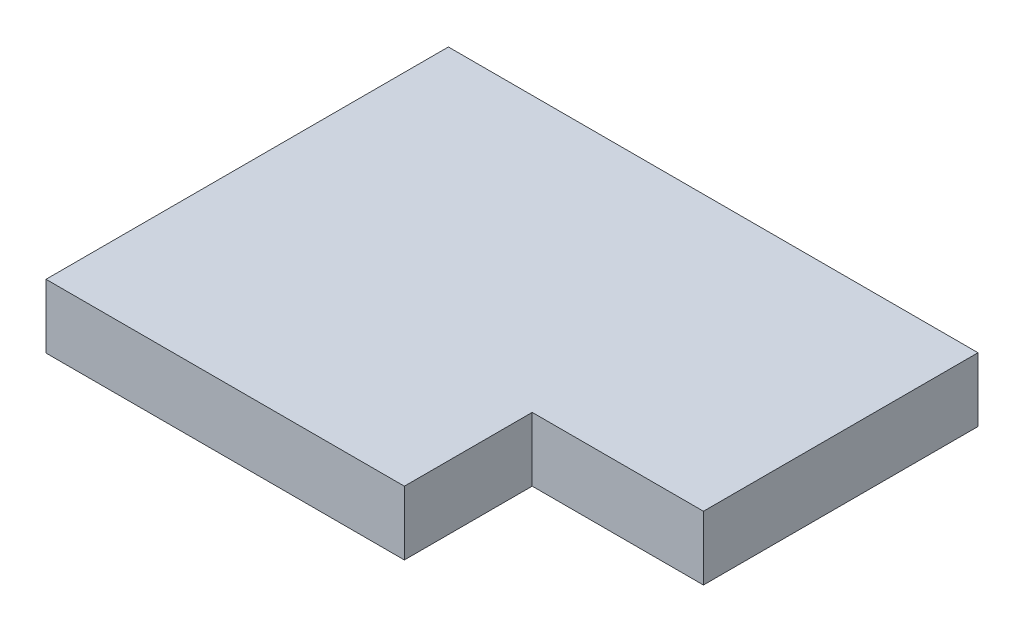
ISO-10303-21;
HEADER;
FILE_DESCRIPTION(('STEP AP214'),'2;1');
FILE_NAME('part.step','',(''),(''),'','','');
FILE_SCHEMA(('AUTOMOTIVE_DESIGN { 1 0 10303 214 1 1 1 1 }'));
ENDSEC;
DATA;
#1=APPLICATION_CONTEXT('core data for automotive mechanical design processes');
#2=APPLICATION_PROTOCOL_DEFINITION('international standard','automotive_design',2000,#1);
#3=PRODUCT_CONTEXT('',#1,'mechanical');
#4=PRODUCT('Part','Part','',(#3));
#5=PRODUCT_RELATED_PRODUCT_CATEGORY('part','',(#4));
#6=PRODUCT_DEFINITION_FORMATION('','',#4);
#7=PRODUCT_DEFINITION_CONTEXT('part definition',#1,'design');
#8=PRODUCT_DEFINITION('design','',#6,#7);
#9=PRODUCT_DEFINITION_SHAPE('','',#8);
#10=(LENGTH_UNIT() NAMED_UNIT(*) SI_UNIT(.MILLI.,.METRE.));
#11=(NAMED_UNIT(*) PLANE_ANGLE_UNIT() SI_UNIT($,.RADIAN.));
#12=(NAMED_UNIT(*) SI_UNIT($,.STERADIAN.) SOLID_ANGLE_UNIT());
#13=UNCERTAINTY_MEASURE_WITH_UNIT(LENGTH_MEASURE(1.E-05),#10,'distance_accuracy_value','');
#14=(GEOMETRIC_REPRESENTATION_CONTEXT(3) GLOBAL_UNCERTAINTY_ASSIGNED_CONTEXT((#13)) GLOBAL_UNIT_ASSIGNED_CONTEXT((#10,
#11,#12)) REPRESENTATION_CONTEXT('',''));
#15=CARTESIAN_POINT('',(0.,0.,0.));
#16=DIRECTION('',(0.,0.,1.));
#17=DIRECTION('',(1.,0.,0.));
#18=AXIS2_PLACEMENT_3D('',#15,#16,#17);
#19=CARTESIAN_POINT('',(435.,105.,-330.5));
#20=DIRECTION('',(-1.,0.,0.));
#21=DIRECTION('',(0.,0.,1.));
#22=AXIS2_PLACEMENT_3D('',#19,#20,#21);
#23=PLANE('',#22);
#24=DIRECTION('',(0.,0.,-1.));
#25=VECTOR('',#24,1.);
#26=CARTESIAN_POINT('',(435.,105.,-330.5));
#27=LINE('',#26,#25);
#28=CARTESIAN_POINT('',(435.,105.,120.5));
#29=VERTEX_POINT('',#28);
#30=CARTESIAN_POINT('',(435.,105.,-330.5));
#31=VERTEX_POINT('',#30);
#32=EDGE_CURVE('E77',#29,#31,#27,.T.);
#33=ORIENTED_EDGE('',*,*,#32,.F.);
#34=DIRECTION('',(0.,1.,0.));
#35=VECTOR('',#34,1.);
#36=CARTESIAN_POINT('',(435.,0.,120.5));
#37=LINE('',#36,#35);
#38=CARTESIAN_POINT('',(435.,0.,120.5));
#39=VERTEX_POINT('',#38);
#40=EDGE_CURVE('E97',#39,#29,#37,.T.);
#41=ORIENTED_EDGE('',*,*,#40,.F.);
#42=DIRECTION('',(0.,0.,-1.));
#43=VECTOR('',#42,1.);
#44=CARTESIAN_POINT('',(435.,0.,-330.5));
#45=LINE('',#44,#43);
#46=CARTESIAN_POINT('',(435.,0.,-330.5));
#47=VERTEX_POINT('',#46);
#48=EDGE_CURVE('E105',#39,#47,#45,.T.);
#49=ORIENTED_EDGE('',*,*,#48,.T.);
#50=DIRECTION('',(0.,-1.,0.));
#51=VECTOR('',#50,1.);
#52=CARTESIAN_POINT('',(435.,105.,-330.5));
#53=LINE('',#52,#51);
#54=EDGE_CURVE('E11',#31,#47,#53,.T.);
#55=ORIENTED_EDGE('',*,*,#54,.F.);
#56=EDGE_LOOP('',(#33,#41,#49,#55));
#57=FACE_BOUND('',#56,.T.);
#58=ADVANCED_FACE('F32',(#57),#23,.F.);
#59=CARTESIAN_POINT('',(-435.,105.,-330.5));
#60=DIRECTION('',(0.,0.,1.));
#61=DIRECTION('',(1.,0.,0.));
#62=AXIS2_PLACEMENT_3D('',#59,#60,#61);
#63=PLANE('',#62);
#64=DIRECTION('',(-1.,0.,0.));
#65=VECTOR('',#64,1.);
#66=CARTESIAN_POINT('',(-435.,0.,-330.5));
#67=LINE('',#66,#65);
#68=CARTESIAN_POINT('',(-435.,0.,-330.5));
#69=VERTEX_POINT('',#68);
#70=EDGE_CURVE('E109',#47,#69,#67,.T.);
#71=ORIENTED_EDGE('',*,*,#70,.T.);
#72=DIRECTION('',(0.,-1.,0.));
#73=VECTOR('',#72,1.);
#74=CARTESIAN_POINT('',(-435.,105.,-330.5));
#75=LINE('',#74,#73);
#76=CARTESIAN_POINT('',(-435.,105.,-330.5));
#77=VERTEX_POINT('',#76);
#78=EDGE_CURVE('E39',#77,#69,#75,.T.);
#79=ORIENTED_EDGE('',*,*,#78,.F.);
#80=DIRECTION('',(-1.,0.,0.));
#81=VECTOR('',#80,1.);
#82=CARTESIAN_POINT('',(-435.,105.,-330.5));
#83=LINE('',#82,#81);
#84=EDGE_CURVE('E132',#31,#77,#83,.T.);
#85=ORIENTED_EDGE('',*,*,#84,.F.);
#86=ORIENTED_EDGE('',*,*,#54,.T.);
#87=EDGE_LOOP('',(#71,#79,#85,#86));
#88=FACE_BOUND('',#87,.T.);
#89=ADVANCED_FACE('F151',(#88),#63,.F.);
#90=CARTESIAN_POINT('',(-435.,105.,-330.5));
#91=DIRECTION('',(1.,0.,0.));
#92=DIRECTION('',(0.,0.,-1.));
#93=AXIS2_PLACEMENT_3D('',#90,#91,#92);
#94=PLANE('',#93);
#95=DIRECTION('',(0.,0.,1.));
#96=VECTOR('',#95,1.);
#97=CARTESIAN_POINT('',(-435.,0.,-330.5));
#98=LINE('',#97,#96);
#99=CARTESIAN_POINT('',(-435.,0.,330.5));
#100=VERTEX_POINT('',#99);
#101=EDGE_CURVE('E72',#69,#100,#98,.T.);
#102=ORIENTED_EDGE('',*,*,#101,.T.);
#103=DIRECTION('',(0.,-1.,0.));
#104=VECTOR('',#103,1.);
#105=CARTESIAN_POINT('',(-435.,105.,330.5));
#106=LINE('',#105,#104);
#107=CARTESIAN_POINT('',(-435.,105.,330.5));
#108=VERTEX_POINT('',#107);
#109=EDGE_CURVE('E123',#108,#100,#106,.T.);
#110=ORIENTED_EDGE('',*,*,#109,.F.);
#111=DIRECTION('',(0.,0.,1.));
#112=VECTOR('',#111,1.);
#113=CARTESIAN_POINT('',(-435.,105.,-330.5));
#114=LINE('',#113,#112);
#115=EDGE_CURVE('E55',#77,#108,#114,.T.);
#116=ORIENTED_EDGE('',*,*,#115,.F.);
#117=ORIENTED_EDGE('',*,*,#78,.T.);
#118=EDGE_LOOP('',(#102,#110,#116,#117));
#119=FACE_BOUND('',#118,.T.);
#120=ADVANCED_FACE('F125',(#119),#94,.F.);
#121=CARTESIAN_POINT('',(-435.,105.,330.5));
#122=DIRECTION('',(0.,0.,-1.));
#123=DIRECTION('',(-1.,0.,0.));
#124=AXIS2_PLACEMENT_3D('',#121,#122,#123);
#125=PLANE('',#124);
#126=DIRECTION('',(1.,0.,0.));
#127=VECTOR('',#126,1.);
#128=CARTESIAN_POINT('',(-435.,0.,330.5));
#129=LINE('',#128,#127);
#130=CARTESIAN_POINT('',(153.7,0.,330.5));
#131=VERTEX_POINT('',#130);
#132=EDGE_CURVE('E120',#100,#131,#129,.T.);
#133=ORIENTED_EDGE('',*,*,#132,.T.);
#134=DIRECTION('',(0.,1.,0.));
#135=VECTOR('',#134,1.);
#136=CARTESIAN_POINT('',(153.7,0.,330.5));
#137=LINE('',#136,#135);
#138=CARTESIAN_POINT('',(153.7,105.,330.5));
#139=VERTEX_POINT('',#138);
#140=EDGE_CURVE('E110',#131,#139,#137,.T.);
#141=ORIENTED_EDGE('',*,*,#140,.T.);
#142=DIRECTION('',(1.,0.,0.));
#143=VECTOR('',#142,1.);
#144=CARTESIAN_POINT('',(-435.,105.,330.5));
#145=LINE('',#144,#143);
#146=EDGE_CURVE('E116',#108,#139,#145,.T.);
#147=ORIENTED_EDGE('',*,*,#146,.F.);
#148=ORIENTED_EDGE('',*,*,#109,.T.);
#149=EDGE_LOOP('',(#133,#141,#147,#148));
#150=FACE_BOUND('',#149,.T.);
#151=ADVANCED_FACE('F129',(#150),#125,.F.);
#152=CARTESIAN_POINT('',(0.,105.,0.));
#153=DIRECTION('',(0.,1.,0.));
#154=DIRECTION('',(0.,0.,1.));
#155=AXIS2_PLACEMENT_3D('',#152,#153,#154);
#156=PLANE('',#155);
#157=DIRECTION('',(0.,0.,1.));
#158=VECTOR('',#157,1.);
#159=CARTESIAN_POINT('',(153.7,105.,330.5));
#160=LINE('',#159,#158);
#161=CARTESIAN_POINT('',(153.7,105.,120.5));
#162=VERTEX_POINT('',#161);
#163=EDGE_CURVE('E101',#162,#139,#160,.T.);
#164=ORIENTED_EDGE('',*,*,#163,.F.);
#165=DIRECTION('',(-1.,0.,0.));
#166=VECTOR('',#165,1.);
#167=CARTESIAN_POINT('',(435.,105.,120.5));
#168=LINE('',#167,#166);
#169=EDGE_CURVE('E138',#29,#162,#168,.T.);
#170=ORIENTED_EDGE('',*,*,#169,.F.);
#171=ORIENTED_EDGE('',*,*,#32,.T.);
#172=ORIENTED_EDGE('',*,*,#84,.T.);
#173=ORIENTED_EDGE('',*,*,#115,.T.);
#174=ORIENTED_EDGE('',*,*,#146,.T.);
#175=EDGE_LOOP('',(#164,#170,#171,#172,#173,#174));
#176=FACE_BOUND('',#175,.T.);
#177=ADVANCED_FACE('F140',(#176),#156,.T.);
#178=CARTESIAN_POINT('',(0.,0.,0.));
#179=DIRECTION('',(0.,1.,0.));
#180=DIRECTION('',(0.,0.,1.));
#181=AXIS2_PLACEMENT_3D('',#178,#179,#180);
#182=PLANE('',#181);
#183=DIRECTION('',(-1.,0.,0.));
#184=VECTOR('',#183,1.);
#185=CARTESIAN_POINT('',(435.,0.,120.5));
#186=LINE('',#185,#184);
#187=CARTESIAN_POINT('',(153.7,0.,120.5));
#188=VERTEX_POINT('',#187);
#189=EDGE_CURVE('E93',#39,#188,#186,.T.);
#190=ORIENTED_EDGE('',*,*,#189,.T.);
#191=DIRECTION('',(0.,0.,1.));
#192=VECTOR('',#191,1.);
#193=CARTESIAN_POINT('',(153.7,0.,330.5));
#194=LINE('',#193,#192);
#195=EDGE_CURVE('E46',#188,#131,#194,.T.);
#196=ORIENTED_EDGE('',*,*,#195,.T.);
#197=ORIENTED_EDGE('',*,*,#132,.F.);
#198=ORIENTED_EDGE('',*,*,#101,.F.);
#199=ORIENTED_EDGE('',*,*,#70,.F.);
#200=ORIENTED_EDGE('',*,*,#48,.F.);
#201=EDGE_LOOP('',(#190,#196,#197,#198,#199,#200));
#202=FACE_BOUND('',#201,.T.);
#203=ADVANCED_FACE('F108',(#202),#182,.F.);
#204=CARTESIAN_POINT('',(153.7,0.,330.5));
#205=DIRECTION('',(-1.,0.,0.));
#206=DIRECTION('',(0.,0.,1.));
#207=AXIS2_PLACEMENT_3D('',#204,#205,#206);
#208=PLANE('',#207);
#209=ORIENTED_EDGE('',*,*,#163,.T.);
#210=ORIENTED_EDGE('',*,*,#140,.F.);
#211=ORIENTED_EDGE('',*,*,#195,.F.);
#212=DIRECTION('',(0.,1.,0.));
#213=VECTOR('',#212,1.);
#214=CARTESIAN_POINT('',(153.7,0.,120.5));
#215=LINE('',#214,#213);
#216=EDGE_CURVE('E98',#188,#162,#215,.T.);
#217=ORIENTED_EDGE('',*,*,#216,.T.);
#218=EDGE_LOOP('',(#209,#210,#211,#217));
#219=FACE_BOUND('',#218,.T.);
#220=ADVANCED_FACE('F141',(#219),#208,.F.);
#221=CARTESIAN_POINT('',(435.,0.,120.5));
#222=DIRECTION('',(0.,0.,-1.));
#223=DIRECTION('',(-1.,0.,0.));
#224=AXIS2_PLACEMENT_3D('',#221,#222,#223);
#225=PLANE('',#224);
#226=ORIENTED_EDGE('',*,*,#169,.T.);
#227=ORIENTED_EDGE('',*,*,#216,.F.);
#228=ORIENTED_EDGE('',*,*,#189,.F.);
#229=ORIENTED_EDGE('',*,*,#40,.T.);
#230=EDGE_LOOP('',(#226,#227,#228,#229));
#231=FACE_BOUND('',#230,.T.);
#232=ADVANCED_FACE('F96',(#231),#225,.F.);
#233=CLOSED_SHELL('',(#58,#89,#120,#151,#177,#203,#220,#232));
#234=MANIFOLD_SOLID_BREP('B2',#233);
#235=ADVANCED_BREP_SHAPE_REPRESENTATION('',(#18,#234),#14);
#236=SHAPE_DEFINITION_REPRESENTATION(#9,#235);
ENDSEC;
END-ISO-10303-21;
